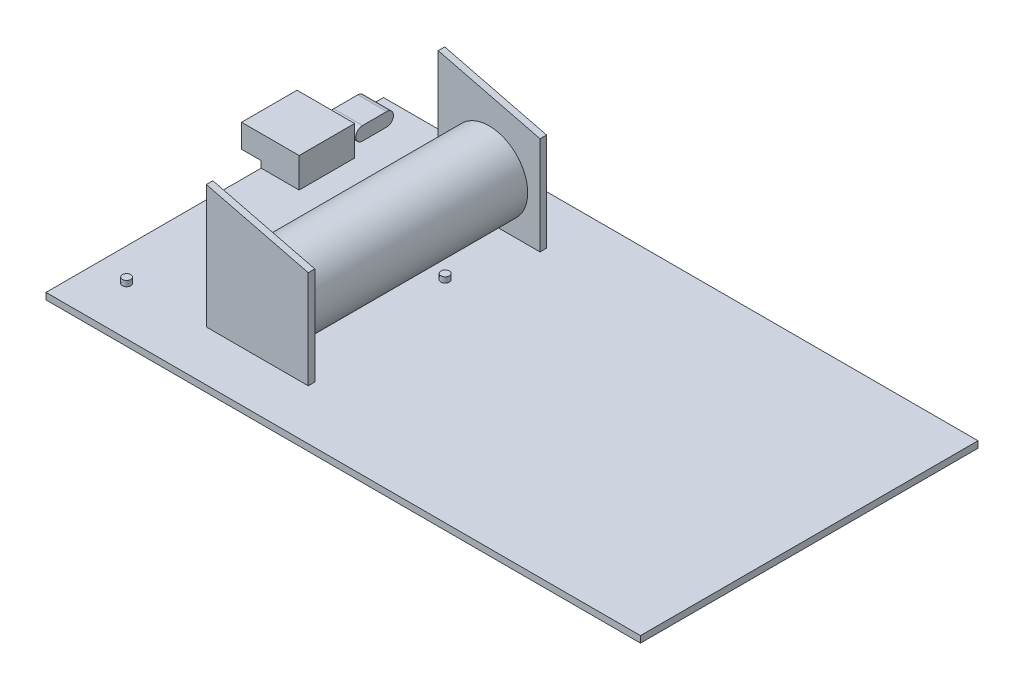
ISO-10303-21;
HEADER;
FILE_DESCRIPTION(('STEP AP214'),'2;1');
FILE_NAME('part.step','',(''),(''),'','','');
FILE_SCHEMA(('AUTOMOTIVE_DESIGN { 1 0 10303 214 1 1 1 1 }'));
ENDSEC;
DATA;
#1=APPLICATION_CONTEXT('core data for automotive mechanical design processes');
#2=APPLICATION_PROTOCOL_DEFINITION('international standard','automotive_design',2000,#1);
#3=PRODUCT_CONTEXT('',#1,'mechanical');
#4=PRODUCT('Part','Part','',(#3));
#5=PRODUCT_RELATED_PRODUCT_CATEGORY('part','',(#4));
#6=PRODUCT_DEFINITION_FORMATION('','',#4);
#7=PRODUCT_DEFINITION_CONTEXT('part definition',#1,'design');
#8=PRODUCT_DEFINITION('design','',#6,#7);
#9=PRODUCT_DEFINITION_SHAPE('','',#8);
#10=(LENGTH_UNIT() NAMED_UNIT(*) SI_UNIT(.MILLI.,.METRE.));
#11=(NAMED_UNIT(*) PLANE_ANGLE_UNIT() SI_UNIT($,.RADIAN.));
#12=(NAMED_UNIT(*) SI_UNIT($,.STERADIAN.) SOLID_ANGLE_UNIT());
#13=UNCERTAINTY_MEASURE_WITH_UNIT(LENGTH_MEASURE(1.E-05),#10,'distance_accuracy_value','');
#14=(GEOMETRIC_REPRESENTATION_CONTEXT(3) GLOBAL_UNCERTAINTY_ASSIGNED_CONTEXT((#13)) GLOBAL_UNIT_ASSIGNED_CONTEXT((#10,
#11,#12)) REPRESENTATION_CONTEXT('',''));
#15=CARTESIAN_POINT('',(0.,0.,0.));
#16=DIRECTION('',(0.,0.,1.));
#17=DIRECTION('',(1.,0.,0.));
#18=AXIS2_PLACEMENT_3D('',#15,#16,#17);
#19=CARTESIAN_POINT('',(0.,1.55,0.));
#20=DIRECTION('',(0.,-1.,0.));
#21=DIRECTION('',(0.,0.,-1.));
#22=AXIS2_PLACEMENT_3D('',#19,#20,#21);
#23=PLANE('',#22);
#24=CARTESIAN_POINT('',(-25.75,1.55,-9.9));
#25=DIRECTION('',(0.,-1.,0.));
#26=DIRECTION('',(0.,0.,-1.));
#27=AXIS2_PLACEMENT_3D('',#24,#25,#26);
#28=CIRCLE('',#27,0.999999999999998);
#29=CARTESIAN_POINT('',(-25.75,1.55,-10.9));
#30=VERTEX_POINT('',#29);
#31=EDGE_CURVE('E11',#30,#30,#28,.F.);
#32=ORIENTED_EDGE('',*,*,#31,.F.);
#33=EDGE_LOOP('',(#32));
#34=FACE_BOUND('',#33,.T.);
#35=CARTESIAN_POINT('',(-62.75,1.55,28.6));
#36=DIRECTION('',(0.,-1.,0.));
#37=DIRECTION('',(0.,0.,-1.));
#38=AXIS2_PLACEMENT_3D('',#35,#36,#37);
#39=CIRCLE('',#38,0.999999999999998);
#40=CARTESIAN_POINT('',(-62.75,1.55,27.6));
#41=VERTEX_POINT('',#40);
#42=EDGE_CURVE('E58',#41,#41,#39,.F.);
#43=ORIENTED_EDGE('',*,*,#42,.F.);
#44=EDGE_LOOP('',(#43));
#45=FACE_BOUND('',#44,.T.);
#46=DIRECTION('',(0.,0.,1.));
#47=VECTOR('',#46,1.);
#48=CARTESIAN_POINT('',(-44.35,1.55,-26.85));
#49=LINE('',#48,#47);
#50=CARTESIAN_POINT('',(-44.35,1.55,-28.4));
#51=VERTEX_POINT('',#50);
#52=CARTESIAN_POINT('',(-44.35,1.55,-26.85));
#53=VERTEX_POINT('',#52);
#54=EDGE_CURVE('E231',#51,#53,#49,.T.);
#55=ORIENTED_EDGE('',*,*,#54,.F.);
#56=DIRECTION('',(-1.,0.,0.));
#57=VECTOR('',#56,1.);
#58=CARTESIAN_POINT('',(-44.35,1.55,-28.4));
#59=LINE('',#58,#57);
#60=CARTESIAN_POINT('',(-20.2,1.55,-28.4));
#61=VERTEX_POINT('',#60);
#62=EDGE_CURVE('E245',#61,#51,#59,.T.);
#63=ORIENTED_EDGE('',*,*,#62,.F.);
#64=DIRECTION('',(0.,0.,-1.));
#65=VECTOR('',#64,1.);
#66=CARTESIAN_POINT('',(-20.2,1.55,-26.85));
#67=LINE('',#66,#65);
#68=CARTESIAN_POINT('',(-20.2,1.55,-26.85));
#69=VERTEX_POINT('',#68);
#70=EDGE_CURVE('E250',#69,#61,#67,.T.);
#71=ORIENTED_EDGE('',*,*,#70,.F.);
#72=DIRECTION('',(1.,0.,0.));
#73=VECTOR('',#72,1.);
#74=CARTESIAN_POINT('',(-44.35,1.55,-26.85));
#75=LINE('',#74,#73);
#76=EDGE_CURVE('E236',#53,#69,#75,.T.);
#77=ORIENTED_EDGE('',*,*,#76,.F.);
#78=EDGE_LOOP('',(#55,#63,#71,#77));
#79=FACE_BOUND('',#78,.T.);
#80=DIRECTION('',(0.,0.,1.));
#81=VECTOR('',#80,1.);
#82=CARTESIAN_POINT('',(-61.45,1.55,0.));
#83=LINE('',#82,#81);
#84=CARTESIAN_POINT('',(-61.45,1.55,-24.15));
#85=VERTEX_POINT('',#84);
#86=CARTESIAN_POINT('',(-61.45,1.55,-11.));
#87=VERTEX_POINT('',#86);
#88=EDGE_CURVE('E318',#85,#87,#83,.T.);
#89=ORIENTED_EDGE('',*,*,#88,.T.);
#90=DIRECTION('',(-1.,0.,0.));
#91=VECTOR('',#90,1.);
#92=CARTESIAN_POINT('',(0.,1.55,-11.));
#93=LINE('',#92,#91);
#94=CARTESIAN_POINT('',(-70.45,1.55,-11.));
#95=VERTEX_POINT('',#94);
#96=EDGE_CURVE('E314',#87,#95,#93,.T.);
#97=ORIENTED_EDGE('',*,*,#96,.T.);
#98=DIRECTION('',(0.,0.,1.));
#99=VECTOR('',#98,1.);
#100=CARTESIAN_POINT('',(-70.45,1.55,40.));
#101=LINE('',#100,#99);
#102=CARTESIAN_POINT('',(-70.45,1.55,40.));
#103=VERTEX_POINT('',#102);
#104=EDGE_CURVE('E372',#95,#103,#101,.T.);
#105=ORIENTED_EDGE('',*,*,#104,.T.);
#106=DIRECTION('',(1.,0.,0.));
#107=VECTOR('',#106,1.);
#108=CARTESIAN_POINT('',(-70.45,1.55,40.));
#109=LINE('',#108,#107);
#110=CARTESIAN_POINT('',(70.45,1.55,40.));
#111=VERTEX_POINT('',#110);
#112=EDGE_CURVE('E377',#103,#111,#109,.T.);
#113=ORIENTED_EDGE('',*,*,#112,.T.);
#114=DIRECTION('',(0.,0.,-1.));
#115=VECTOR('',#114,1.);
#116=CARTESIAN_POINT('',(70.45,1.55,40.));
#117=LINE('',#116,#115);
#118=CARTESIAN_POINT('',(70.45,1.55,-40.));
#119=VERTEX_POINT('',#118);
#120=EDGE_CURVE('E364',#111,#119,#117,.T.);
#121=ORIENTED_EDGE('',*,*,#120,.T.);
#122=DIRECTION('',(-1.,0.,0.));
#123=VECTOR('',#122,1.);
#124=CARTESIAN_POINT('',(-70.45,1.55,-40.));
#125=LINE('',#124,#123);
#126=CARTESIAN_POINT('',(-70.45,1.55,-40.));
#127=VERTEX_POINT('',#126);
#128=EDGE_CURVE('E368',#119,#127,#125,.T.);
#129=ORIENTED_EDGE('',*,*,#128,.T.);
#130=CARTESIAN_POINT('',(-70.45,1.55,-34.3));
#131=VERTEX_POINT('',#130);
#132=EDGE_CURVE('E373',#127,#131,#101,.T.);
#133=ORIENTED_EDGE('',*,*,#132,.T.);
#134=DIRECTION('',(1.,0.,0.));
#135=VECTOR('',#134,1.);
#136=CARTESIAN_POINT('',(-70.85,1.55,-34.3));
#137=LINE('',#136,#135);
#138=CARTESIAN_POINT('',(-64.,1.55,-34.3));
#139=VERTEX_POINT('',#138);
#140=EDGE_CURVE('E411',#139,#131,#137,.F.);
#141=ORIENTED_EDGE('',*,*,#140,.F.);
#142=DIRECTION('',(0.,0.,1.));
#143=VECTOR('',#142,1.);
#144=CARTESIAN_POINT('',(-64.,1.55,-34.3));
#145=LINE('',#144,#143);
#146=CARTESIAN_POINT('',(-64.,1.55,-28.56));
#147=VERTEX_POINT('',#146);
#148=EDGE_CURVE('E325',#139,#147,#145,.T.);
#149=ORIENTED_EDGE('',*,*,#148,.T.);
#150=DIRECTION('',(1.,0.,0.));
#151=VECTOR('',#150,1.);
#152=CARTESIAN_POINT('',(-70.85,1.55,-28.56));
#153=LINE('',#152,#151);
#154=CARTESIAN_POINT('',(-70.45,1.55,-28.56));
#155=VERTEX_POINT('',#154);
#156=EDGE_CURVE('E408',#147,#155,#153,.F.);
#157=ORIENTED_EDGE('',*,*,#156,.T.);
#158=CARTESIAN_POINT('',(-70.45,1.55,-24.15));
#159=VERTEX_POINT('',#158);
#160=EDGE_CURVE('E613',#155,#159,#101,.T.);
#161=ORIENTED_EDGE('',*,*,#160,.T.);
#162=DIRECTION('',(1.,0.,0.));
#163=VECTOR('',#162,1.);
#164=CARTESIAN_POINT('',(0.,1.55,-24.15));
#165=LINE('',#164,#163);
#166=EDGE_CURVE('E303',#159,#85,#165,.T.);
#167=ORIENTED_EDGE('',*,*,#166,.T.);
#168=EDGE_LOOP('',(#89,#97,#105,#113,#121,#129,#133,#141,#149,#157,#161,#167));
#169=FACE_BOUND('',#168,.T.);
#170=DIRECTION('',(0.,0.,1.));
#171=VECTOR('',#170,1.);
#172=CARTESIAN_POINT('',(-44.35,1.55,28.1));
#173=LINE('',#172,#171);
#174=CARTESIAN_POINT('',(-44.35,1.55,26.55));
#175=VERTEX_POINT('',#174);
#176=CARTESIAN_POINT('',(-44.35,1.55,28.1));
#177=VERTEX_POINT('',#176);
#178=EDGE_CURVE('E229',#175,#177,#173,.T.);
#179=ORIENTED_EDGE('',*,*,#178,.F.);
#180=DIRECTION('',(-1.,0.,0.));
#181=VECTOR('',#180,1.);
#182=CARTESIAN_POINT('',(-44.35,1.55,26.55));
#183=LINE('',#182,#181);
#184=CARTESIAN_POINT('',(-20.2,1.55,26.55));
#185=VERTEX_POINT('',#184);
#186=EDGE_CURVE('E218',#185,#175,#183,.T.);
#187=ORIENTED_EDGE('',*,*,#186,.F.);
#188=DIRECTION('',(0.,0.,-1.));
#189=VECTOR('',#188,1.);
#190=CARTESIAN_POINT('',(-20.2,1.55,28.1));
#191=LINE('',#190,#189);
#192=CARTESIAN_POINT('',(-20.2,1.55,28.1));
#193=VERTEX_POINT('',#192);
#194=EDGE_CURVE('E452',#193,#185,#191,.T.);
#195=ORIENTED_EDGE('',*,*,#194,.F.);
#196=DIRECTION('',(1.,0.,0.));
#197=VECTOR('',#196,1.);
#198=CARTESIAN_POINT('',(-44.35,1.55,28.1));
#199=LINE('',#198,#197);
#200=EDGE_CURVE('E65',#177,#193,#199,.T.);
#201=ORIENTED_EDGE('',*,*,#200,.F.);
#202=EDGE_LOOP('',(#179,#187,#195,#201));
#203=FACE_BOUND('',#202,.T.);
#204=ADVANCED_FACE('F49',(#34,#45,#79,#169,#203),#23,.F.);
#205=CARTESIAN_POINT('',(70.45,1.55,40.));
#206=DIRECTION('',(-1.,0.,0.));
#207=DIRECTION('',(0.,0.,1.));
#208=AXIS2_PLACEMENT_3D('',#205,#206,#207);
#209=PLANE('',#208);
#210=DIRECTION('',(0.,0.,-1.));
#211=VECTOR('',#210,1.);
#212=CARTESIAN_POINT('',(70.45,0.,40.));
#213=LINE('',#212,#211);
#214=CARTESIAN_POINT('',(70.45,0.,40.));
#215=VERTEX_POINT('',#214);
#216=CARTESIAN_POINT('',(70.45,0.,-40.));
#217=VERTEX_POINT('',#216);
#218=EDGE_CURVE('E363',#215,#217,#213,.T.);
#219=ORIENTED_EDGE('',*,*,#218,.T.);
#220=DIRECTION('',(0.,-1.,0.));
#221=VECTOR('',#220,1.);
#222=CARTESIAN_POINT('',(70.45,1.55,-40.));
#223=LINE('',#222,#221);
#224=EDGE_CURVE('E404',#119,#217,#223,.T.);
#225=ORIENTED_EDGE('',*,*,#224,.F.);
#226=ORIENTED_EDGE('',*,*,#120,.F.);
#227=DIRECTION('',(0.,-1.,0.));
#228=VECTOR('',#227,1.);
#229=CARTESIAN_POINT('',(70.45,1.55,40.));
#230=LINE('',#229,#228);
#231=EDGE_CURVE('E381',#111,#215,#230,.T.);
#232=ORIENTED_EDGE('',*,*,#231,.T.);
#233=EDGE_LOOP('',(#219,#225,#226,#232));
#234=FACE_BOUND('',#233,.T.);
#235=ADVANCED_FACE('F51',(#234),#209,.F.);
#236=CARTESIAN_POINT('',(-70.45,1.55,-40.));
#237=DIRECTION('',(0.,0.,1.));
#238=DIRECTION('',(1.,0.,0.));
#239=AXIS2_PLACEMENT_3D('',#236,#237,#238);
#240=PLANE('',#239);
#241=DIRECTION('',(-1.,0.,0.));
#242=VECTOR('',#241,1.);
#243=CARTESIAN_POINT('',(-70.45,0.,-40.));
#244=LINE('',#243,#242);
#245=CARTESIAN_POINT('',(-70.45,0.,-40.));
#246=VERTEX_POINT('',#245);
#247=EDGE_CURVE('E385',#217,#246,#244,.T.);
#248=ORIENTED_EDGE('',*,*,#247,.T.);
#249=DIRECTION('',(0.,-1.,0.));
#250=VECTOR('',#249,1.);
#251=CARTESIAN_POINT('',(-70.45,1.55,-40.));
#252=LINE('',#251,#250);
#253=EDGE_CURVE('E400',#127,#246,#252,.T.);
#254=ORIENTED_EDGE('',*,*,#253,.F.);
#255=ORIENTED_EDGE('',*,*,#128,.F.);
#256=ORIENTED_EDGE('',*,*,#224,.T.);
#257=EDGE_LOOP('',(#248,#254,#255,#256));
#258=FACE_BOUND('',#257,.T.);
#259=ADVANCED_FACE('F593',(#258),#240,.F.);
#260=CARTESIAN_POINT('',(-70.45,1.55,40.));
#261=DIRECTION('',(1.,0.,0.));
#262=DIRECTION('',(0.,0.,-1.));
#263=AXIS2_PLACEMENT_3D('',#260,#261,#262);
#264=PLANE('',#263);
#265=DIRECTION('',(0.,-1.,0.));
#266=VECTOR('',#265,1.);
#267=CARTESIAN_POINT('',(-70.45,0.,-24.15));
#268=LINE('',#267,#266);
#269=CARTESIAN_POINT('',(-70.45,3.1,-24.15));
#270=VERTEX_POINT('',#269);
#271=EDGE_CURVE('E418',#270,#159,#268,.T.);
#272=ORIENTED_EDGE('',*,*,#271,.T.);
#273=ORIENTED_EDGE('',*,*,#160,.F.);
#274=EDGE_CURVE('E378',#131,#155,#101,.T.);
#275=ORIENTED_EDGE('',*,*,#274,.F.);
#276=ORIENTED_EDGE('',*,*,#132,.F.);
#277=ORIENTED_EDGE('',*,*,#253,.T.);
#278=DIRECTION('',(0.,0.,1.));
#279=VECTOR('',#278,1.);
#280=CARTESIAN_POINT('',(-70.45,0.,40.));
#281=LINE('',#280,#279);
#282=CARTESIAN_POINT('',(-70.45,0.,40.));
#283=VERTEX_POINT('',#282);
#284=EDGE_CURVE('E388',#246,#283,#281,.T.);
#285=ORIENTED_EDGE('',*,*,#284,.T.);
#286=DIRECTION('',(0.,-1.,0.));
#287=VECTOR('',#286,1.);
#288=CARTESIAN_POINT('',(-70.45,1.55,40.));
#289=LINE('',#288,#287);
#290=EDGE_CURVE('E396',#103,#283,#289,.T.);
#291=ORIENTED_EDGE('',*,*,#290,.F.);
#292=ORIENTED_EDGE('',*,*,#104,.F.);
#293=DIRECTION('',(0.,1.,0.));
#294=VECTOR('',#293,1.);
#295=CARTESIAN_POINT('',(-70.45,0.,-11.));
#296=LINE('',#295,#294);
#297=CARTESIAN_POINT('',(-70.45,3.1,-11.));
#298=VERTEX_POINT('',#297);
#299=EDGE_CURVE('E270',#95,#298,#296,.T.);
#300=ORIENTED_EDGE('',*,*,#299,.T.);
#301=DIRECTION('',(0.,0.,1.));
#302=VECTOR('',#301,1.);
#303=CARTESIAN_POINT('',(-70.45,3.1,-25.1));
#304=LINE('',#303,#302);
#305=EDGE_CURVE('E277',#270,#298,#304,.T.);
#306=ORIENTED_EDGE('',*,*,#305,.F.);
#307=EDGE_LOOP('',(#272,#273,#275,#276,#277,#285,#291,#292,#300,#306));
#308=FACE_BOUND('',#307,.T.);
#309=ADVANCED_FACE('F590',(#308),#264,.F.);
#310=CARTESIAN_POINT('',(-70.45,1.55,40.));
#311=DIRECTION('',(0.,0.,-1.));
#312=DIRECTION('',(-1.,0.,0.));
#313=AXIS2_PLACEMENT_3D('',#310,#311,#312);
#314=PLANE('',#313);
#315=DIRECTION('',(1.,0.,0.));
#316=VECTOR('',#315,1.);
#317=CARTESIAN_POINT('',(-70.45,0.,40.));
#318=LINE('',#317,#316);
#319=EDGE_CURVE('E369',#283,#215,#318,.T.);
#320=ORIENTED_EDGE('',*,*,#319,.T.);
#321=ORIENTED_EDGE('',*,*,#231,.F.);
#322=ORIENTED_EDGE('',*,*,#112,.F.);
#323=ORIENTED_EDGE('',*,*,#290,.T.);
#324=EDGE_LOOP('',(#320,#321,#322,#323));
#325=FACE_BOUND('',#324,.T.);
#326=ADVANCED_FACE('F586',(#325),#314,.F.);
#327=CARTESIAN_POINT('',(0.,0.,0.));
#328=DIRECTION('',(0.,-1.,0.));
#329=DIRECTION('',(0.,0.,-1.));
#330=AXIS2_PLACEMENT_3D('',#327,#328,#329);
#331=PLANE('',#330);
#332=ORIENTED_EDGE('',*,*,#319,.F.);
#333=ORIENTED_EDGE('',*,*,#284,.F.);
#334=ORIENTED_EDGE('',*,*,#247,.F.);
#335=ORIENTED_EDGE('',*,*,#218,.F.);
#336=EDGE_LOOP('',(#332,#333,#334,#335));
#337=FACE_BOUND('',#336,.T.);
#338=ADVANCED_FACE('F579',(#337),#331,.T.);
#339=CARTESIAN_POINT('',(-70.85,1.55,-34.3));
#340=DIRECTION('',(0.,1.,0.));
#341=DIRECTION('',(0.,0.,1.));
#342=AXIS2_PLACEMENT_3D('',#339,#340,#341);
#343=PLANE('',#342);
#344=DIRECTION('',(1.,0.,0.));
#345=VECTOR('',#344,1.);
#346=CARTESIAN_POINT('',(-70.85,1.55,-34.3));
#347=LINE('',#346,#345);
#348=CARTESIAN_POINT('',(-70.85,1.55,-34.3));
#349=VERTEX_POINT('',#348);
#350=EDGE_CURVE('E359',#349,#131,#347,.T.);
#351=ORIENTED_EDGE('',*,*,#350,.T.);
#352=ORIENTED_EDGE('',*,*,#274,.T.);
#353=DIRECTION('',(1.,0.,0.));
#354=VECTOR('',#353,1.);
#355=CARTESIAN_POINT('',(-70.85,1.55,-28.56));
#356=LINE('',#355,#354);
#357=CARTESIAN_POINT('',(-70.85,1.55,-28.56));
#358=VERTEX_POINT('',#357);
#359=EDGE_CURVE('E355',#358,#155,#356,.T.);
#360=ORIENTED_EDGE('',*,*,#359,.F.);
#361=DIRECTION('',(0.,0.,1.));
#362=VECTOR('',#361,1.);
#363=CARTESIAN_POINT('',(-70.85,1.55,-34.3));
#364=LINE('',#363,#362);
#365=EDGE_CURVE('E340',#349,#358,#364,.T.);
#366=ORIENTED_EDGE('',*,*,#365,.F.);
#367=EDGE_LOOP('',(#351,#352,#360,#366));
#368=FACE_BOUND('',#367,.T.);
#369=ADVANCED_FACE('F576',(#368),#343,.F.);
#370=CARTESIAN_POINT('',(-70.85,3.15,-34.3));
#371=DIRECTION('',(1.,0.,0.));
#372=DIRECTION('',(0.,0.,-1.));
#373=AXIS2_PLACEMENT_3D('',#370,#371,#372);
#374=CYLINDRICAL_SURFACE('',#373,1.6);
#375=DIRECTION('',(1.,0.,0.));
#376=VECTOR('',#375,1.);
#377=CARTESIAN_POINT('',(-70.85,4.75,-34.3));
#378=LINE('',#377,#376);
#379=CARTESIAN_POINT('',(-70.85,4.75,-34.3));
#380=VERTEX_POINT('',#379);
#381=CARTESIAN_POINT('',(-64.,4.75,-34.3));
#382=VERTEX_POINT('',#381);
#383=EDGE_CURVE('E349',#380,#382,#378,.T.);
#384=ORIENTED_EDGE('',*,*,#383,.T.);
#385=CARTESIAN_POINT('',(-64.,3.15,-34.3));
#386=DIRECTION('',(-1.,0.,0.));
#387=DIRECTION('',(0.,0.,1.));
#388=AXIS2_PLACEMENT_3D('',#385,#386,#387);
#389=CIRCLE('',#388,1.6);
#390=EDGE_CURVE('E321',#382,#139,#389,.T.);
#391=ORIENTED_EDGE('',*,*,#390,.T.);
#392=ORIENTED_EDGE('',*,*,#140,.T.);
#393=ORIENTED_EDGE('',*,*,#350,.F.);
#394=CARTESIAN_POINT('',(-70.85,3.15,-34.3));
#395=DIRECTION('',(-1.,0.,0.));
#396=DIRECTION('',(0.,0.,1.));
#397=AXIS2_PLACEMENT_3D('',#394,#395,#396);
#398=CIRCLE('',#397,1.6);
#399=EDGE_CURVE('E336',#380,#349,#398,.T.);
#400=ORIENTED_EDGE('',*,*,#399,.F.);
#401=EDGE_LOOP('',(#384,#391,#392,#393,#400));
#402=FACE_BOUND('',#401,.T.);
#403=ADVANCED_FACE('F574',(#402),#374,.T.);
#404=CARTESIAN_POINT('',(-70.85,3.15,-28.56));
#405=DIRECTION('',(1.,0.,0.));
#406=DIRECTION('',(0.,0.,-1.));
#407=AXIS2_PLACEMENT_3D('',#404,#405,#406);
#408=CYLINDRICAL_SURFACE('',#407,1.6);
#409=ORIENTED_EDGE('',*,*,#359,.T.);
#410=ORIENTED_EDGE('',*,*,#156,.F.);
#411=CARTESIAN_POINT('',(-64.,3.15,-28.56));
#412=DIRECTION('',(-1.,0.,0.));
#413=DIRECTION('',(0.,0.,1.));
#414=AXIS2_PLACEMENT_3D('',#411,#412,#413);
#415=CIRCLE('',#414,1.6);
#416=CARTESIAN_POINT('',(-64.,4.75,-28.56));
#417=VERTEX_POINT('',#416);
#418=EDGE_CURVE('E328',#147,#417,#415,.T.);
#419=ORIENTED_EDGE('',*,*,#418,.T.);
#420=DIRECTION('',(1.,0.,0.));
#421=VECTOR('',#420,1.);
#422=CARTESIAN_POINT('',(-70.85,4.75,-28.56));
#423=LINE('',#422,#421);
#424=CARTESIAN_POINT('',(-70.85,4.75,-28.56));
#425=VERTEX_POINT('',#424);
#426=EDGE_CURVE('E352',#425,#417,#423,.T.);
#427=ORIENTED_EDGE('',*,*,#426,.F.);
#428=CARTESIAN_POINT('',(-70.85,3.15,-28.56));
#429=DIRECTION('',(-1.,0.,0.));
#430=DIRECTION('',(0.,0.,1.));
#431=AXIS2_PLACEMENT_3D('',#428,#429,#430);
#432=CIRCLE('',#431,1.6);
#433=EDGE_CURVE('E343',#358,#425,#432,.T.);
#434=ORIENTED_EDGE('',*,*,#433,.F.);
#435=EDGE_LOOP('',(#409,#410,#419,#427,#434));
#436=FACE_BOUND('',#435,.T.);
#437=ADVANCED_FACE('F570',(#436),#408,.T.);
#438=CARTESIAN_POINT('',(-70.85,4.75,-34.3));
#439=DIRECTION('',(0.,-1.,0.));
#440=DIRECTION('',(0.,0.,-1.));
#441=AXIS2_PLACEMENT_3D('',#438,#439,#440);
#442=PLANE('',#441);
#443=ORIENTED_EDGE('',*,*,#426,.T.);
#444=DIRECTION('',(0.,0.,-1.));
#445=VECTOR('',#444,1.);
#446=CARTESIAN_POINT('',(-64.,4.75,-34.3));
#447=LINE('',#446,#445);
#448=EDGE_CURVE('E332',#417,#382,#447,.T.);
#449=ORIENTED_EDGE('',*,*,#448,.T.);
#450=ORIENTED_EDGE('',*,*,#383,.F.);
#451=DIRECTION('',(0.,0.,-1.));
#452=VECTOR('',#451,1.);
#453=CARTESIAN_POINT('',(-70.85,4.75,-34.3));
#454=LINE('',#453,#452);
#455=EDGE_CURVE('E346',#425,#380,#454,.T.);
#456=ORIENTED_EDGE('',*,*,#455,.F.);
#457=EDGE_LOOP('',(#443,#449,#450,#456));
#458=FACE_BOUND('',#457,.T.);
#459=ADVANCED_FACE('F566',(#458),#442,.F.);
#460=CARTESIAN_POINT('',(-70.85,3.15,-34.3));
#461=DIRECTION('',(-1.,0.,0.));
#462=DIRECTION('',(0.,0.,1.));
#463=AXIS2_PLACEMENT_3D('',#460,#461,#462);
#464=PLANE('',#463);
#465=ORIENTED_EDGE('',*,*,#399,.T.);
#466=ORIENTED_EDGE('',*,*,#365,.T.);
#467=ORIENTED_EDGE('',*,*,#433,.T.);
#468=ORIENTED_EDGE('',*,*,#455,.T.);
#469=EDGE_LOOP('',(#465,#466,#467,#468));
#470=FACE_BOUND('',#469,.T.);
#471=ADVANCED_FACE('F562',(#470),#464,.T.);
#472=CARTESIAN_POINT('',(-64.,3.15,-34.3));
#473=DIRECTION('',(-1.,0.,0.));
#474=DIRECTION('',(0.,0.,1.));
#475=AXIS2_PLACEMENT_3D('',#472,#473,#474);
#476=PLANE('',#475);
#477=ORIENTED_EDGE('',*,*,#390,.F.);
#478=ORIENTED_EDGE('',*,*,#448,.F.);
#479=ORIENTED_EDGE('',*,*,#418,.F.);
#480=ORIENTED_EDGE('',*,*,#148,.F.);
#481=EDGE_LOOP('',(#477,#478,#479,#480));
#482=FACE_BOUND('',#481,.T.);
#483=ADVANCED_FACE('F558',(#482),#476,.F.);
#484=CARTESIAN_POINT('',(-61.45,0.,-11.));
#485=DIRECTION('',(1.,0.,0.));
#486=DIRECTION('',(0.,0.,-1.));
#487=AXIS2_PLACEMENT_3D('',#484,#485,#486);
#488=PLANE('',#487);
#489=ORIENTED_EDGE('',*,*,#88,.F.);
#490=DIRECTION('',(0.,1.,0.));
#491=VECTOR('',#490,1.);
#492=CARTESIAN_POINT('',(-61.45,0.,-24.15));
#493=LINE('',#492,#491);
#494=CARTESIAN_POINT('',(-61.45,8.65,-24.15));
#495=VERTEX_POINT('',#494);
#496=EDGE_CURVE('E299',#85,#495,#493,.T.);
#497=ORIENTED_EDGE('',*,*,#496,.T.);
#498=DIRECTION('',(0.,0.,-1.));
#499=VECTOR('',#498,1.);
#500=CARTESIAN_POINT('',(-61.45,8.65,-11.));
#501=LINE('',#500,#499);
#502=CARTESIAN_POINT('',(-61.45,8.65,-11.));
#503=VERTEX_POINT('',#502);
#504=EDGE_CURVE('E283',#503,#495,#501,.T.);
#505=ORIENTED_EDGE('',*,*,#504,.F.);
#506=DIRECTION('',(0.,1.,0.));
#507=VECTOR('',#506,1.);
#508=CARTESIAN_POINT('',(-61.45,0.,-11.));
#509=LINE('',#508,#507);
#510=EDGE_CURVE('E300',#87,#503,#509,.T.);
#511=ORIENTED_EDGE('',*,*,#510,.F.);
#512=EDGE_LOOP('',(#489,#497,#505,#511));
#513=FACE_BOUND('',#512,.T.);
#514=ADVANCED_FACE('F548',(#513),#488,.T.);
#515=CARTESIAN_POINT('',(-61.45,0.,-11.));
#516=DIRECTION('',(0.,0.,1.));
#517=DIRECTION('',(1.,0.,0.));
#518=AXIS2_PLACEMENT_3D('',#515,#516,#517);
#519=PLANE('',#518);
#520=ORIENTED_EDGE('',*,*,#299,.F.);
#521=ORIENTED_EDGE('',*,*,#96,.F.);
#522=ORIENTED_EDGE('',*,*,#510,.T.);
#523=DIRECTION('',(1.,0.,0.));
#524=VECTOR('',#523,1.);
#525=CARTESIAN_POINT('',(-61.45,8.65,-11.));
#526=LINE('',#525,#524);
#527=CARTESIAN_POINT('',(-75.1,8.65,-11.));
#528=VERTEX_POINT('',#527);
#529=EDGE_CURVE('E295',#528,#503,#526,.T.);
#530=ORIENTED_EDGE('',*,*,#529,.F.);
#531=DIRECTION('',(0.,1.,0.));
#532=VECTOR('',#531,1.);
#533=CARTESIAN_POINT('',(-75.1,0.,-11.));
#534=LINE('',#533,#532);
#535=CARTESIAN_POINT('',(-75.1,3.1,-11.));
#536=VERTEX_POINT('',#535);
#537=EDGE_CURVE('E304',#536,#528,#534,.T.);
#538=ORIENTED_EDGE('',*,*,#537,.F.);
#539=DIRECTION('',(-1.,0.,0.));
#540=VECTOR('',#539,1.);
#541=CARTESIAN_POINT('',(-70.45,3.1,-11.));
#542=LINE('',#541,#540);
#543=EDGE_CURVE('E274',#298,#536,#542,.T.);
#544=ORIENTED_EDGE('',*,*,#543,.F.);
#545=EDGE_LOOP('',(#520,#521,#522,#530,#538,#544));
#546=FACE_BOUND('',#545,.T.);
#547=ADVANCED_FACE('F544',(#546),#519,.T.);
#548=CARTESIAN_POINT('',(-61.45,0.,-24.15));
#549=DIRECTION('',(0.,0.,-1.));
#550=DIRECTION('',(-1.,0.,0.));
#551=AXIS2_PLACEMENT_3D('',#548,#549,#550);
#552=PLANE('',#551);
#553=ORIENTED_EDGE('',*,*,#271,.F.);
#554=DIRECTION('',(1.,0.,0.));
#555=VECTOR('',#554,1.);
#556=CARTESIAN_POINT('',(-61.45,3.1,-24.15));
#557=LINE('',#556,#555);
#558=CARTESIAN_POINT('',(-75.1,3.1,-24.15));
#559=VERTEX_POINT('',#558);
#560=EDGE_CURVE('E280',#559,#270,#557,.T.);
#561=ORIENTED_EDGE('',*,*,#560,.F.);
#562=DIRECTION('',(0.,1.,0.));
#563=VECTOR('',#562,1.);
#564=CARTESIAN_POINT('',(-75.1,0.,-24.15));
#565=LINE('',#564,#563);
#566=CARTESIAN_POINT('',(-75.1,8.65,-24.15));
#567=VERTEX_POINT('',#566);
#568=EDGE_CURVE('E307',#559,#567,#565,.T.);
#569=ORIENTED_EDGE('',*,*,#568,.T.);
#570=DIRECTION('',(-1.,0.,0.));
#571=VECTOR('',#570,1.);
#572=CARTESIAN_POINT('',(-61.45,8.65,-24.15));
#573=LINE('',#572,#571);
#574=EDGE_CURVE('E287',#495,#567,#573,.T.);
#575=ORIENTED_EDGE('',*,*,#574,.F.);
#576=ORIENTED_EDGE('',*,*,#496,.F.);
#577=ORIENTED_EDGE('',*,*,#166,.F.);
#578=EDGE_LOOP('',(#553,#561,#569,#575,#576,#577));
#579=FACE_BOUND('',#578,.T.);
#580=ADVANCED_FACE('F547',(#579),#552,.T.);
#581=CARTESIAN_POINT('',(-75.1,0.,-11.));
#582=DIRECTION('',(-1.,0.,0.));
#583=DIRECTION('',(0.,0.,1.));
#584=AXIS2_PLACEMENT_3D('',#581,#582,#583);
#585=PLANE('',#584);
#586=DIRECTION('',(0.,0.,-1.));
#587=VECTOR('',#586,1.);
#588=CARTESIAN_POINT('',(-75.1,3.1,-11.));
#589=LINE('',#588,#587);
#590=EDGE_CURVE('E415',#536,#559,#589,.T.);
#591=ORIENTED_EDGE('',*,*,#590,.F.);
#592=ORIENTED_EDGE('',*,*,#537,.T.);
#593=DIRECTION('',(0.,0.,1.));
#594=VECTOR('',#593,1.);
#595=CARTESIAN_POINT('',(-75.1,8.65,-11.));
#596=LINE('',#595,#594);
#597=EDGE_CURVE('E291',#567,#528,#596,.T.);
#598=ORIENTED_EDGE('',*,*,#597,.F.);
#599=ORIENTED_EDGE('',*,*,#568,.F.);
#600=EDGE_LOOP('',(#591,#592,#598,#599));
#601=FACE_BOUND('',#600,.T.);
#602=ADVANCED_FACE('F542',(#601),#585,.T.);
#603=CARTESIAN_POINT('',(0.,8.65,0.));
#604=DIRECTION('',(0.,1.,0.));
#605=DIRECTION('',(0.,0.,1.));
#606=AXIS2_PLACEMENT_3D('',#603,#604,#605);
#607=PLANE('',#606);
#608=ORIENTED_EDGE('',*,*,#504,.T.);
#609=ORIENTED_EDGE('',*,*,#574,.T.);
#610=ORIENTED_EDGE('',*,*,#597,.T.);
#611=ORIENTED_EDGE('',*,*,#529,.T.);
#612=EDGE_LOOP('',(#608,#609,#610,#611));
#613=FACE_BOUND('',#612,.T.);
#614=ADVANCED_FACE('F538',(#613),#607,.T.);
#615=CARTESIAN_POINT('',(-70.45,3.1,-25.1));
#616=DIRECTION('',(0.,1.,0.));
#617=DIRECTION('',(-1.,0.,0.));
#618=AXIS2_PLACEMENT_3D('',#615,#616,#617);
#619=PLANE('',#618);
#620=ORIENTED_EDGE('',*,*,#560,.T.);
#621=ORIENTED_EDGE('',*,*,#305,.T.);
#622=ORIENTED_EDGE('',*,*,#543,.T.);
#623=ORIENTED_EDGE('',*,*,#590,.T.);
#624=EDGE_LOOP('',(#620,#621,#622,#623));
#625=FACE_BOUND('',#624,.T.);
#626=ADVANCED_FACE('F534',(#625),#619,.F.);
#627=CARTESIAN_POINT('',(-44.35,30.8,-26.85));
#628=DIRECTION('',(1.,0.,0.));
#629=DIRECTION('',(0.,0.,-1.));
#630=AXIS2_PLACEMENT_3D('',#627,#628,#629);
#631=PLANE('',#630);
#632=ORIENTED_EDGE('',*,*,#54,.T.);
#633=DIRECTION('',(0.,-1.,0.));
#634=VECTOR('',#633,1.);
#635=CARTESIAN_POINT('',(-44.35,30.8,-26.85));
#636=LINE('',#635,#634);
#637=CARTESIAN_POINT('',(-44.35,30.8,-26.85));
#638=VERTEX_POINT('',#637);
#639=EDGE_CURVE('E266',#638,#53,#636,.T.);
#640=ORIENTED_EDGE('',*,*,#639,.F.);
#641=DIRECTION('',(0.,0.,1.));
#642=VECTOR('',#641,1.);
#643=CARTESIAN_POINT('',(-44.35,30.8,-26.85));
#644=LINE('',#643,#642);
#645=CARTESIAN_POINT('',(-44.35,30.8,-28.4));
#646=VERTEX_POINT('',#645);
#647=EDGE_CURVE('E242',#646,#638,#644,.T.);
#648=ORIENTED_EDGE('',*,*,#647,.F.);
#649=DIRECTION('',(0.,-1.,0.));
#650=VECTOR('',#649,1.);
#651=CARTESIAN_POINT('',(-44.35,30.8,-28.4));
#652=LINE('',#651,#650);
#653=EDGE_CURVE('E244',#646,#51,#652,.T.);
#654=ORIENTED_EDGE('',*,*,#653,.T.);
#655=EDGE_LOOP('',(#632,#640,#648,#654));
#656=FACE_BOUND('',#655,.T.);
#657=ADVANCED_FACE('F530',(#656),#631,.F.);
#658=CARTESIAN_POINT('',(-44.35,30.8,-26.85));
#659=DIRECTION('',(0.,0.,-1.));
#660=DIRECTION('',(-1.,0.,0.));
#661=AXIS2_PLACEMENT_3D('',#658,#659,#660);
#662=PLANE('',#661);
#663=CARTESIAN_POINT('',(-32.275,12.25,-26.85));
#664=DIRECTION('',(0.,0.,-1.));
#665=DIRECTION('',(-1.,0.,0.));
#666=AXIS2_PLACEMENT_3D('',#663,#664,#665);
#667=CIRCLE('',#666,9.15);
#668=CARTESIAN_POINT('',(-41.425,12.25,-26.85));
#669=VERTEX_POINT('',#668);
#670=EDGE_CURVE('E426',#669,#669,#667,.F.);
#671=ORIENTED_EDGE('',*,*,#670,.F.);
#672=EDGE_LOOP('',(#671));
#673=FACE_BOUND('',#672,.T.);
#674=DIRECTION('',(0.,-1.,0.));
#675=VECTOR('',#674,1.);
#676=CARTESIAN_POINT('',(-20.2,30.8,-26.85));
#677=LINE('',#676,#675);
#678=CARTESIAN_POINT('',(-20.2,24.7787287313374,-26.85));
#679=VERTEX_POINT('',#678);
#680=EDGE_CURVE('E263',#679,#69,#677,.T.);
#681=ORIENTED_EDGE('',*,*,#680,.F.);
#682=DIRECTION('',(-0.970295726275998,0.241921895599661,0.));
#683=VECTOR('',#682,1.);
#684=CARTESIAN_POINT('',(-44.35,30.8,-26.85));
#685=LINE('',#684,#683);
#686=EDGE_CURVE('E446',#679,#638,#685,.T.);
#687=ORIENTED_EDGE('',*,*,#686,.T.);
#688=ORIENTED_EDGE('',*,*,#639,.T.);
#689=ORIENTED_EDGE('',*,*,#76,.T.);
#690=EDGE_LOOP('',(#681,#687,#688,#689));
#691=FACE_BOUND('',#690,.T.);
#692=ADVANCED_FACE('F526',(#673,#691),#662,.F.);
#693=CARTESIAN_POINT('',(-20.2,30.8,-26.85));
#694=DIRECTION('',(-1.,0.,0.));
#695=DIRECTION('',(0.,0.,1.));
#696=AXIS2_PLACEMENT_3D('',#693,#694,#695);
#697=PLANE('',#696);
#698=DIRECTION('',(0.,-1.,0.));
#699=VECTOR('',#698,1.);
#700=CARTESIAN_POINT('',(-20.2,30.8,-28.4));
#701=LINE('',#700,#699);
#702=CARTESIAN_POINT('',(-20.2,24.7787287313374,-28.4));
#703=VERTEX_POINT('',#702);
#704=EDGE_CURVE('E260',#703,#61,#701,.T.);
#705=ORIENTED_EDGE('',*,*,#704,.F.);
#706=DIRECTION('',(0.,0.,1.));
#707=VECTOR('',#706,1.);
#708=CARTESIAN_POINT('',(-20.2,24.7787287313374,-60.9));
#709=LINE('',#708,#707);
#710=EDGE_CURVE('E471',#703,#679,#709,.T.);
#711=ORIENTED_EDGE('',*,*,#710,.T.);
#712=ORIENTED_EDGE('',*,*,#680,.T.);
#713=ORIENTED_EDGE('',*,*,#70,.T.);
#714=EDGE_LOOP('',(#705,#711,#712,#713));
#715=FACE_BOUND('',#714,.T.);
#716=ADVANCED_FACE('F522',(#715),#697,.F.);
#717=CARTESIAN_POINT('',(-44.35,30.8,-28.4));
#718=DIRECTION('',(0.,0.,1.));
#719=DIRECTION('',(1.,0.,0.));
#720=AXIS2_PLACEMENT_3D('',#717,#718,#719);
#721=PLANE('',#720);
#722=ORIENTED_EDGE('',*,*,#653,.F.);
#723=DIRECTION('',(0.970295726275998,-0.241921895599661,0.));
#724=VECTOR('',#723,1.);
#725=CARTESIAN_POINT('',(-44.35,30.8,-28.4));
#726=LINE('',#725,#724);
#727=EDGE_CURVE('E465',#646,#703,#726,.T.);
#728=ORIENTED_EDGE('',*,*,#727,.T.);
#729=ORIENTED_EDGE('',*,*,#704,.T.);
#730=ORIENTED_EDGE('',*,*,#62,.T.);
#731=EDGE_LOOP('',(#722,#728,#729,#730));
#732=FACE_BOUND('',#731,.T.);
#733=ADVANCED_FACE('F519',(#732),#721,.F.);
#734=CARTESIAN_POINT('',(-44.35,30.8,28.1));
#735=DIRECTION('',(1.,0.,0.));
#736=DIRECTION('',(0.,0.,-1.));
#737=AXIS2_PLACEMENT_3D('',#734,#735,#736);
#738=PLANE('',#737);
#739=ORIENTED_EDGE('',*,*,#178,.T.);
#740=DIRECTION('',(0.,-1.,0.));
#741=VECTOR('',#740,1.);
#742=CARTESIAN_POINT('',(-44.35,30.8,28.1));
#743=LINE('',#742,#741);
#744=CARTESIAN_POINT('',(-44.35,30.8,28.1));
#745=VERTEX_POINT('',#744);
#746=EDGE_CURVE('E222',#745,#177,#743,.T.);
#747=ORIENTED_EDGE('',*,*,#746,.F.);
#748=DIRECTION('',(0.,0.,1.));
#749=VECTOR('',#748,1.);
#750=CARTESIAN_POINT('',(-44.35,30.8,28.1));
#751=LINE('',#750,#749);
#752=CARTESIAN_POINT('',(-44.35,30.8,26.55));
#753=VERTEX_POINT('',#752);
#754=EDGE_CURVE('E206',#753,#745,#751,.T.);
#755=ORIENTED_EDGE('',*,*,#754,.F.);
#756=DIRECTION('',(0.,-1.,0.));
#757=VECTOR('',#756,1.);
#758=CARTESIAN_POINT('',(-44.35,30.8,26.55));
#759=LINE('',#758,#757);
#760=EDGE_CURVE('E217',#753,#175,#759,.T.);
#761=ORIENTED_EDGE('',*,*,#760,.T.);
#762=EDGE_LOOP('',(#739,#747,#755,#761));
#763=FACE_BOUND('',#762,.T.);
#764=ADVANCED_FACE('F228',(#763),#738,.F.);
#765=CARTESIAN_POINT('',(-44.35,30.8,28.1));
#766=DIRECTION('',(0.,0.,-1.));
#767=DIRECTION('',(-1.,0.,0.));
#768=AXIS2_PLACEMENT_3D('',#765,#766,#767);
#769=PLANE('',#768);
#770=DIRECTION('',(0.,-1.,0.));
#771=VECTOR('',#770,1.);
#772=CARTESIAN_POINT('',(-20.2,30.8,28.1));
#773=LINE('',#772,#771);
#774=CARTESIAN_POINT('',(-20.2,24.7787287313374,28.1));
#775=VERTEX_POINT('',#774);
#776=EDGE_CURVE('E73',#775,#193,#773,.T.);
#777=ORIENTED_EDGE('',*,*,#776,.F.);
#778=DIRECTION('',(0.970295726275998,-0.241921895599661,0.));
#779=VECTOR('',#778,1.);
#780=CARTESIAN_POINT('',(-44.35,30.8,28.1));
#781=LINE('',#780,#779);
#782=EDGE_CURVE('E209',#745,#775,#781,.T.);
#783=ORIENTED_EDGE('',*,*,#782,.F.);
#784=ORIENTED_EDGE('',*,*,#746,.T.);
#785=ORIENTED_EDGE('',*,*,#200,.T.);
#786=EDGE_LOOP('',(#777,#783,#784,#785));
#787=FACE_BOUND('',#786,.T.);
#788=ADVANCED_FACE('F221',(#787),#769,.F.);
#789=CARTESIAN_POINT('',(-20.2,30.8,28.1));
#790=DIRECTION('',(-1.,0.,0.));
#791=DIRECTION('',(0.,0.,1.));
#792=AXIS2_PLACEMENT_3D('',#789,#790,#791);
#793=PLANE('',#792);
#794=DIRECTION('',(0.,-1.,0.));
#795=VECTOR('',#794,1.);
#796=CARTESIAN_POINT('',(-20.2,30.8,26.55));
#797=LINE('',#796,#795);
#798=CARTESIAN_POINT('',(-20.2,24.7787287313374,26.55));
#799=VERTEX_POINT('',#798);
#800=EDGE_CURVE('E238',#799,#185,#797,.T.);
#801=ORIENTED_EDGE('',*,*,#800,.F.);
#802=EDGE_CURVE('E225',#799,#775,#709,.T.);
#803=ORIENTED_EDGE('',*,*,#802,.T.);
#804=ORIENTED_EDGE('',*,*,#776,.T.);
#805=ORIENTED_EDGE('',*,*,#194,.T.);
#806=EDGE_LOOP('',(#801,#803,#804,#805));
#807=FACE_BOUND('',#806,.T.);
#808=ADVANCED_FACE('F511',(#807),#793,.F.);
#809=CARTESIAN_POINT('',(-44.35,30.8,26.55));
#810=DIRECTION('',(0.,0.,1.));
#811=DIRECTION('',(1.,0.,0.));
#812=AXIS2_PLACEMENT_3D('',#809,#810,#811);
#813=PLANE('',#812);
#814=CARTESIAN_POINT('',(-32.275,12.25,26.55));
#815=DIRECTION('',(0.,0.,1.));
#816=DIRECTION('',(1.,0.,0.));
#817=AXIS2_PLACEMENT_3D('',#814,#815,#816);
#818=CIRCLE('',#817,9.15);
#819=CARTESIAN_POINT('',(-23.125,12.25,26.55));
#820=VERTEX_POINT('',#819);
#821=EDGE_CURVE('E422',#820,#820,#818,.F.);
#822=ORIENTED_EDGE('',*,*,#821,.F.);
#823=EDGE_LOOP('',(#822));
#824=FACE_BOUND('',#823,.T.);
#825=ORIENTED_EDGE('',*,*,#760,.F.);
#826=DIRECTION('',(0.970295726275998,-0.241921895599661,0.));
#827=VECTOR('',#826,1.);
#828=CARTESIAN_POINT('',(-44.35,30.8,26.55));
#829=LINE('',#828,#827);
#830=EDGE_CURVE('E211',#753,#799,#829,.T.);
#831=ORIENTED_EDGE('',*,*,#830,.T.);
#832=ORIENTED_EDGE('',*,*,#800,.T.);
#833=ORIENTED_EDGE('',*,*,#186,.T.);
#834=EDGE_LOOP('',(#825,#831,#832,#833));
#835=FACE_BOUND('',#834,.T.);
#836=ADVANCED_FACE('F449',(#824,#835),#813,.F.);
#837=CARTESIAN_POINT('',(-44.35,30.8,-60.9));
#838=DIRECTION('',(-0.241921895599661,-0.970295726275998,0.));
#839=DIRECTION('',(0.970295726275998,-0.241921895599661,0.));
#840=AXIS2_PLACEMENT_3D('',#837,#838,#839);
#841=PLANE('',#840);
#842=ORIENTED_EDGE('',*,*,#754,.T.);
#843=ORIENTED_EDGE('',*,*,#782,.T.);
#844=ORIENTED_EDGE('',*,*,#802,.F.);
#845=ORIENTED_EDGE('',*,*,#830,.F.);
#846=EDGE_LOOP('',(#842,#843,#844,#845));
#847=FACE_BOUND('',#846,.T.);
#848=ADVANCED_FACE('F208',(#847),#841,.F.);
#849=ORIENTED_EDGE('',*,*,#710,.F.);
#850=ORIENTED_EDGE('',*,*,#727,.F.);
#851=ORIENTED_EDGE('',*,*,#647,.T.);
#852=ORIENTED_EDGE('',*,*,#686,.F.);
#853=EDGE_LOOP('',(#849,#850,#851,#852));
#854=FACE_BOUND('',#853,.T.);
#855=ADVANCED_FACE('F504',(#854),#841,.F.);
#856=CARTESIAN_POINT('',(-32.275,12.25,27.15));
#857=DIRECTION('',(0.,0.,-1.));
#858=DIRECTION('',(-1.,0.,0.));
#859=AXIS2_PLACEMENT_3D('',#856,#857,#858);
#860=CYLINDRICAL_SURFACE('',#859,9.15);
#861=ORIENTED_EDGE('',*,*,#670,.T.);
#862=EDGE_LOOP('',(#861));
#863=FACE_BOUND('',#862,.T.);
#864=ORIENTED_EDGE('',*,*,#821,.T.);
#865=EDGE_LOOP('',(#864));
#866=FACE_BOUND('',#865,.T.);
#867=ADVANCED_FACE('F500',(#863,#866),#860,.T.);
#868=CARTESIAN_POINT('',(-62.75,2.85,28.6));
#869=DIRECTION('',(0.,-1.,0.));
#870=DIRECTION('',(0.,0.,-1.));
#871=AXIS2_PLACEMENT_3D('',#868,#869,#870);
#872=CYLINDRICAL_SURFACE('',#871,0.999999999999998);
#873=CARTESIAN_POINT('',(-62.75,2.85,28.6));
#874=DIRECTION('',(0.,1.,0.));
#875=DIRECTION('',(0.,0.,1.));
#876=AXIS2_PLACEMENT_3D('',#873,#874,#875);
#877=CIRCLE('',#876,0.999999999999998);
#878=CARTESIAN_POINT('',(-62.75,2.85,29.6));
#879=VERTEX_POINT('',#878);
#880=EDGE_CURVE('E226',#879,#879,#877,.T.);
#881=ORIENTED_EDGE('',*,*,#880,.F.);
#882=EDGE_LOOP('',(#881));
#883=FACE_BOUND('',#882,.T.);
#884=ORIENTED_EDGE('',*,*,#42,.T.);
#885=EDGE_LOOP('',(#884));
#886=FACE_BOUND('',#885,.T.);
#887=ADVANCED_FACE('F433',(#883,#886),#872,.T.);
#888=CARTESIAN_POINT('',(-62.75,2.85,28.6));
#889=DIRECTION('',(0.,1.,0.));
#890=DIRECTION('',(0.,0.,1.));
#891=AXIS2_PLACEMENT_3D('',#888,#889,#890);
#892=PLANE('',#891);
#893=ORIENTED_EDGE('',*,*,#880,.T.);
#894=EDGE_LOOP('',(#893));
#895=FACE_BOUND('',#894,.T.);
#896=ADVANCED_FACE('F487',(#895),#892,.T.);
#897=CARTESIAN_POINT('',(-25.75,2.85,-9.9));
#898=DIRECTION('',(0.,-1.,0.));
#899=DIRECTION('',(0.,0.,-1.));
#900=AXIS2_PLACEMENT_3D('',#897,#898,#899);
#901=CYLINDRICAL_SURFACE('',#900,0.999999999999998);
#902=CARTESIAN_POINT('',(-25.75,2.85,-9.9));
#903=DIRECTION('',(0.,1.,0.));
#904=DIRECTION('',(0.,0.,1.));
#905=AXIS2_PLACEMENT_3D('',#902,#903,#904);
#906=CIRCLE('',#905,0.999999999999998);
#907=CARTESIAN_POINT('',(-25.75,2.85,-8.9));
#908=VERTEX_POINT('',#907);
#909=EDGE_CURVE('E477',#908,#908,#906,.T.);
#910=ORIENTED_EDGE('',*,*,#909,.F.);
#911=EDGE_LOOP('',(#910));
#912=FACE_BOUND('',#911,.T.);
#913=ORIENTED_EDGE('',*,*,#31,.T.);
#914=EDGE_LOOP('',(#913));
#915=FACE_BOUND('',#914,.T.);
#916=ADVANCED_FACE('F484',(#912,#915),#901,.T.);
#917=CARTESIAN_POINT('',(-25.75,2.85,-9.9));
#918=DIRECTION('',(0.,1.,0.));
#919=DIRECTION('',(0.,0.,1.));
#920=AXIS2_PLACEMENT_3D('',#917,#918,#919);
#921=PLANE('',#920);
#922=ORIENTED_EDGE('',*,*,#909,.T.);
#923=EDGE_LOOP('',(#922));
#924=FACE_BOUND('',#923,.T.);
#925=ADVANCED_FACE('F482',(#924),#921,.T.);
#926=CLOSED_SHELL('',(#204,#235,#259,#309,#326,#338,#369,#403,#437,#459,#471,#483,#514,#547,
#580,#602,#614,#626,#657,#692,#716,#733,#764,#788,#808,#836,#848,#855,#867,#887,#896,#916,#925));
#927=MANIFOLD_SOLID_BREP('B2',#926);
#928=ADVANCED_BREP_SHAPE_REPRESENTATION('',(#18,#927),#14);
#929=SHAPE_DEFINITION_REPRESENTATION(#9,#928);
ENDSEC;
END-ISO-10303-21;
